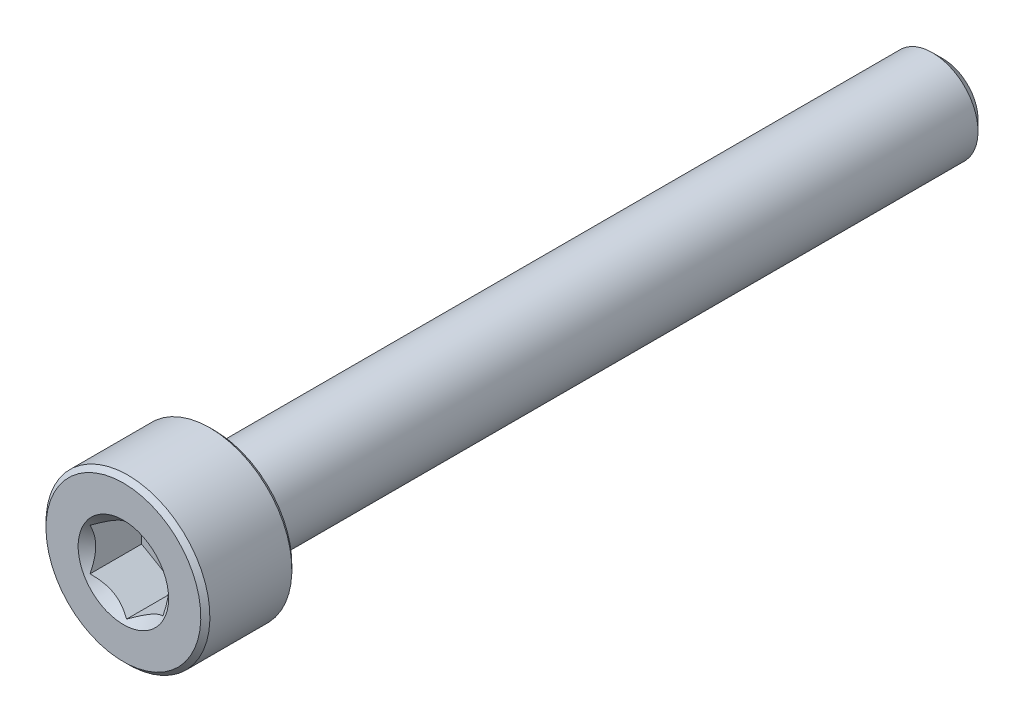
ISO-10303-21;
HEADER;
FILE_DESCRIPTION(('STEP AP214'),'2;1');
FILE_NAME('part.step','',(''),(''),'','','');
FILE_SCHEMA(('AUTOMOTIVE_DESIGN { 1 0 10303 214 1 1 1 1 }'));
ENDSEC;
DATA;
#1=APPLICATION_CONTEXT('core data for automotive mechanical design processes');
#2=APPLICATION_PROTOCOL_DEFINITION('international standard','automotive_design',2000,#1);
#3=PRODUCT_CONTEXT('',#1,'mechanical');
#4=PRODUCT('Part','Part','',(#3));
#5=PRODUCT_RELATED_PRODUCT_CATEGORY('part','',(#4));
#6=PRODUCT_DEFINITION_FORMATION('','',#4);
#7=PRODUCT_DEFINITION_CONTEXT('part definition',#1,'design');
#8=PRODUCT_DEFINITION('design','',#6,#7);
#9=PRODUCT_DEFINITION_SHAPE('','',#8);
#10=(LENGTH_UNIT() NAMED_UNIT(*) SI_UNIT(.MILLI.,.METRE.));
#11=(NAMED_UNIT(*) PLANE_ANGLE_UNIT() SI_UNIT($,.RADIAN.));
#12=(NAMED_UNIT(*) SI_UNIT($,.STERADIAN.) SOLID_ANGLE_UNIT());
#13=UNCERTAINTY_MEASURE_WITH_UNIT(LENGTH_MEASURE(1.E-05),#10,'distance_accuracy_value','');
#14=(GEOMETRIC_REPRESENTATION_CONTEXT(3) GLOBAL_UNCERTAINTY_ASSIGNED_CONTEXT((#13)) GLOBAL_UNIT_ASSIGNED_CONTEXT((#10,
#11,#12)) REPRESENTATION_CONTEXT('',''));
#15=CARTESIAN_POINT('',(0.,0.,0.));
#16=DIRECTION('',(0.,0.,1.));
#17=DIRECTION('',(1.,0.,0.));
#18=AXIS2_PLACEMENT_3D('',#15,#16,#17);
#19=CARTESIAN_POINT('',(0.,0.957716426222752,-11.25));
#20=DIRECTION('',(0.,0.,-1.));
#21=DIRECTION('',(0.,1.,0.));
#22=AXIS2_PLACEMENT_3D('',#19,#20,#21);
#23=PLANE('',#22);
#24=CARTESIAN_POINT('',(0.,0.,-11.25));
#25=DIRECTION('',(0.,0.,-1.));
#26=DIRECTION('',(0.,1.,0.));
#27=AXIS2_PLACEMENT_3D('',#24,#25,#26);
#28=CIRCLE('',#27,0.957716426222752);
#29=CARTESIAN_POINT('',(0.,0.957716426222752,-11.25));
#30=VERTEX_POINT('',#29);
#31=EDGE_CURVE('E50',#30,#30,#28,.T.);
#32=ORIENTED_EDGE('',*,*,#31,.T.);
#33=EDGE_LOOP('',(#32));
#34=FACE_BOUND('',#33,.T.);
#35=ADVANCED_FACE('F37',(#34),#23,.T.);
#36=CARTESIAN_POINT('',(0.,0.,-11.25));
#37=DIRECTION('',(0.,0.,1.));
#38=DIRECTION('',(0.,-1.,0.));
#39=AXIS2_PLACEMENT_3D('',#36,#37,#38);
#40=CONICAL_SURFACE('',#39,0.957716426222752,0.785398163397447);
#41=CARTESIAN_POINT('',(0.,0.,-10.9577164262228));
#42=DIRECTION('',(0.,0.,-1.));
#43=DIRECTION('',(0.,1.,0.));
#44=AXIS2_PLACEMENT_3D('',#41,#42,#43);
#45=CIRCLE('',#44,1.25);
#46=CARTESIAN_POINT('',(0.,1.25,-10.9577164262228));
#47=VERTEX_POINT('',#46);
#48=EDGE_CURVE('E153',#47,#47,#45,.T.);
#49=ORIENTED_EDGE('',*,*,#48,.T.);
#50=EDGE_LOOP('',(#49));
#51=FACE_BOUND('',#50,.T.);
#52=ORIENTED_EDGE('',*,*,#31,.F.);
#53=EDGE_LOOP('',(#52));
#54=FACE_BOUND('',#53,.T.);
#55=ADVANCED_FACE('F159',(#51,#54),#40,.T.);
#56=CARTESIAN_POINT('',(0.,0.,-11.25));
#57=DIRECTION('',(0.,0.,-1.));
#58=DIRECTION('',(0.,1.,0.));
#59=AXIS2_PLACEMENT_3D('',#56,#57,#58);
#60=CYLINDRICAL_SURFACE('',#59,1.25);
#61=CARTESIAN_POINT('',(0.,0.,8.625));
#62=DIRECTION('',(0.,0.,-1.));
#63=DIRECTION('',(0.,1.,0.));
#64=AXIS2_PLACEMENT_3D('',#61,#62,#63);
#65=CIRCLE('',#64,1.25);
#66=CARTESIAN_POINT('',(0.,1.25,8.625));
#67=VERTEX_POINT('',#66);
#68=EDGE_CURVE('E150',#67,#67,#65,.T.);
#69=ORIENTED_EDGE('',*,*,#68,.T.);
#70=EDGE_LOOP('',(#69));
#71=FACE_BOUND('',#70,.T.);
#72=ORIENTED_EDGE('',*,*,#48,.F.);
#73=EDGE_LOOP('',(#72));
#74=FACE_BOUND('',#73,.T.);
#75=ADVANCED_FACE('F161',(#71,#74),#60,.T.);
#76=CARTESIAN_POINT('',(0.,0.,8.625));
#77=DIRECTION('',(0.,0.,-1.));
#78=DIRECTION('',(0.,1.,0.));
#79=AXIS2_PLACEMENT_3D('',#76,#77,#78);
#80=TOROIDAL_SURFACE('',#79,1.375,0.125);
#81=CARTESIAN_POINT('',(0.,0.,8.75));
#82=DIRECTION('',(0.,0.,-1.));
#83=DIRECTION('',(0.,1.,0.));
#84=AXIS2_PLACEMENT_3D('',#81,#82,#83);
#85=CIRCLE('',#84,1.375);
#86=CARTESIAN_POINT('',(0.,1.375,8.75));
#87=VERTEX_POINT('',#86);
#88=EDGE_CURVE('E147',#87,#87,#85,.T.);
#89=ORIENTED_EDGE('',*,*,#88,.T.);
#90=EDGE_LOOP('',(#89));
#91=FACE_BOUND('',#90,.T.);
#92=ORIENTED_EDGE('',*,*,#68,.F.);
#93=EDGE_LOOP('',(#92));
#94=FACE_BOUND('',#93,.T.);
#95=ADVANCED_FACE('F167',(#91,#94),#80,.F.);
#96=CARTESIAN_POINT('',(0.,2.125,8.75));
#97=DIRECTION('',(0.,0.,-1.));
#98=DIRECTION('',(0.,1.,0.));
#99=AXIS2_PLACEMENT_3D('',#96,#97,#98);
#100=PLANE('',#99);
#101=CARTESIAN_POINT('',(0.,0.,8.75));
#102=DIRECTION('',(0.,0.,-1.));
#103=DIRECTION('',(0.,1.,0.));
#104=AXIS2_PLACEMENT_3D('',#101,#102,#103);
#105=CIRCLE('',#104,2.125);
#106=CARTESIAN_POINT('',(0.,2.125,8.75));
#107=VERTEX_POINT('',#106);
#108=EDGE_CURVE('E144',#107,#107,#105,.T.);
#109=ORIENTED_EDGE('',*,*,#108,.T.);
#110=EDGE_LOOP('',(#109));
#111=FACE_BOUND('',#110,.T.);
#112=ORIENTED_EDGE('',*,*,#88,.F.);
#113=EDGE_LOOP('',(#112));
#114=FACE_BOUND('',#113,.T.);
#115=ADVANCED_FACE('F173',(#111,#114),#100,.T.);
#116=CARTESIAN_POINT('',(0.,0.,8.75));
#117=DIRECTION('',(0.,0.,1.));
#118=DIRECTION('',(0.,-1.,0.));
#119=AXIS2_PLACEMENT_3D('',#116,#117,#118);
#120=CONICAL_SURFACE('',#119,2.125,0.78539816339745);
#121=CARTESIAN_POINT('',(0.,0.,8.875));
#122=DIRECTION('',(0.,0.,-1.));
#123=DIRECTION('',(0.,1.,0.));
#124=AXIS2_PLACEMENT_3D('',#121,#122,#123);
#125=CIRCLE('',#124,2.25);
#126=CARTESIAN_POINT('',(0.,2.25,8.875));
#127=VERTEX_POINT('',#126);
#128=EDGE_CURVE('E141',#127,#127,#125,.T.);
#129=ORIENTED_EDGE('',*,*,#128,.T.);
#130=EDGE_LOOP('',(#129));
#131=FACE_BOUND('',#130,.T.);
#132=ORIENTED_EDGE('',*,*,#108,.F.);
#133=EDGE_LOOP('',(#132));
#134=FACE_BOUND('',#133,.T.);
#135=ADVANCED_FACE('F177',(#131,#134),#120,.T.);
#136=CARTESIAN_POINT('',(0.,0.,-11.25));
#137=DIRECTION('',(0.,0.,-1.));
#138=DIRECTION('',(0.,1.,0.));
#139=AXIS2_PLACEMENT_3D('',#136,#137,#138);
#140=CYLINDRICAL_SURFACE('',#139,2.25);
#141=CARTESIAN_POINT('',(0.,0.,11.125));
#142=DIRECTION('',(0.,0.,-1.));
#143=DIRECTION('',(0.,1.,0.));
#144=AXIS2_PLACEMENT_3D('',#141,#142,#143);
#145=CIRCLE('',#144,2.25);
#146=CARTESIAN_POINT('',(0.,2.25,11.125));
#147=VERTEX_POINT('',#146);
#148=EDGE_CURVE('E138',#147,#147,#145,.T.);
#149=ORIENTED_EDGE('',*,*,#148,.T.);
#150=EDGE_LOOP('',(#149));
#151=FACE_BOUND('',#150,.T.);
#152=ORIENTED_EDGE('',*,*,#128,.F.);
#153=EDGE_LOOP('',(#152));
#154=FACE_BOUND('',#153,.T.);
#155=ADVANCED_FACE('F181',(#151,#154),#140,.T.);
#156=CARTESIAN_POINT('',(0.,0.,11.125));
#157=DIRECTION('',(0.,0.,-1.));
#158=DIRECTION('',(0.,1.,0.));
#159=AXIS2_PLACEMENT_3D('',#156,#157,#158);
#160=CONICAL_SURFACE('',#159,2.25,0.78539816339745);
#161=CARTESIAN_POINT('',(0.,0.,11.25));
#162=DIRECTION('',(0.,0.,-1.));
#163=DIRECTION('',(0.,1.,0.));
#164=AXIS2_PLACEMENT_3D('',#161,#162,#163);
#165=CIRCLE('',#164,2.125);
#166=CARTESIAN_POINT('',(0.,2.125,11.25));
#167=VERTEX_POINT('',#166);
#168=EDGE_CURVE('E135',#167,#167,#165,.T.);
#169=ORIENTED_EDGE('',*,*,#168,.T.);
#170=EDGE_LOOP('',(#169));
#171=FACE_BOUND('',#170,.T.);
#172=ORIENTED_EDGE('',*,*,#148,.F.);
#173=EDGE_LOOP('',(#172));
#174=FACE_BOUND('',#173,.T.);
#175=ADVANCED_FACE('F185',(#171,#174),#160,.T.);
#176=CARTESIAN_POINT('',(0.,0.,11.25));
#177=DIRECTION('',(0.,0.,1.));
#178=DIRECTION('',(0.,-1.,0.));
#179=AXIS2_PLACEMENT_3D('',#176,#177,#178);
#180=PLANE('',#179);
#181=CARTESIAN_POINT('',(0.,0.,11.25));
#182=DIRECTION('',(0.,0.,1.));
#183=DIRECTION('',(1.,0.,0.));
#184=AXIS2_PLACEMENT_3D('',#181,#182,#183);
#185=CIRCLE('',#184,1.2413030787577);
#186=CARTESIAN_POINT('',(1.2413030787577,0.,11.25));
#187=VERTEX_POINT('',#186);
#188=EDGE_CURVE('E109',#187,#187,#185,.T.);
#189=ORIENTED_EDGE('',*,*,#188,.F.);
#190=EDGE_LOOP('',(#189));
#191=FACE_BOUND('',#190,.T.);
#192=ORIENTED_EDGE('',*,*,#168,.F.);
#193=EDGE_LOOP('',(#192));
#194=FACE_BOUND('',#193,.T.);
#195=ADVANCED_FACE('F189',(#191,#194),#180,.T.);
#196=CARTESIAN_POINT('',(0.,0.,11.25));
#197=DIRECTION('',(0.,0.,1.));
#198=DIRECTION('',(1.,0.,0.));
#199=AXIS2_PLACEMENT_3D('',#196,#197,#198);
#200=CONICAL_SURFACE('',#199,1.2413030787577,0.78539816339745);
#201=ORIENTED_EDGE('',*,*,#188,.T.);
#202=EDGE_LOOP('',(#201));
#203=FACE_BOUND('',#202,.T.);
#204=CARTESIAN_POINT('',(-0.00019999999999932,-1.15481600843309,11.1635129469942));
#205=CARTESIAN_POINT('',(0.0341825950071818,-1.13496520795026,11.1436753904473));
#206=CARTESIAN_POINT('',(0.0691401181398261,-1.11478247255942,11.1250024802604));
#207=CARTESIAN_POINT('',(0.140422802956091,-1.07362739529219,11.0908122023447));
#208=CARTESIAN_POINT('',(0.176754750528985,-1.0526511355808,11.075313868645));
#209=CARTESIAN_POINT('',(0.250016613803312,-1.01035337909803,11.0487647667638));
#210=CARTESIAN_POINT('',(0.286927851445415,-0.989042666109241,11.0376472336185));
#211=CARTESIAN_POINT('',(0.36156272931086,-0.945952199282691,11.0205173253977));
#212=CARTESIAN_POINT('',(0.399284088108636,-0.924173762626596,11.0144921570882));
#213=CARTESIAN_POINT('',(0.464292198417934,-0.886641312640014,11.0090580145891));
#214=CARTESIAN_POINT('',(0.491494371528173,-0.870936130672275,11.0082543979383));
#215=CARTESIAN_POINT('',(0.545846040669112,-0.839556179862848,11.0096041590384));
#216=CARTESIAN_POINT('',(0.572995523754876,-0.823881418494923,11.0117581891688));
#217=CARTESIAN_POINT('',(0.654056277326961,-0.777080970599367,11.02251443175));
#218=CARTESIAN_POINT('',(0.707564140978428,-0.74618819111643,11.0354120160369));
#219=CARTESIAN_POINT('',(0.801476065143432,-0.691968116419649,11.0665381902237));
#220=CARTESIAN_POINT('',(0.842320523671834,-0.668386557293372,11.0831352573234));
#221=CARTESIAN_POINT('',(0.922409637381943,-0.622147085933682,11.1205223843068));
#222=CARTESIAN_POINT('',(0.961659010870437,-0.599486449584575,11.141298801439));
#223=CARTESIAN_POINT('',(1.0002,-0.577234799135788,11.1635129469942));
#224=B_SPLINE_CURVE_WITH_KNOTS('',3,(#204,#205,#206,#207,#208,#209,#210,#211,#212,#213,#214,
#215,#216,#217,#218,#219,#220,#221,#222,#223),.UNSPECIFIED.,.F.,.F.,(4,2,2,2,2,2,2,2,2,4),(0.,
0.13323767682856,0.26725222983449,0.3991370762693,0.530689603280768,0.624814864263846,
0.718960890149133,0.907306626112097,1.05710100361789,1.20641411519286),.UNSPECIFIED.);
#225=CARTESIAN_POINT('',(0.,-1.15470053837925,11.1633974596216));
#226=VERTEX_POINT('',#225);
#227=CARTESIAN_POINT('',(1.,-0.577350269189626,11.1633974596216));
#228=VERTEX_POINT('',#227);
#229=EDGE_CURVE('E12',#226,#228,#224,.T.);
#230=ORIENTED_EDGE('',*,*,#229,.F.);
#231=CARTESIAN_POINT('',(-1.0002,-0.577234799135788,11.1635129469942));
#232=CARTESIAN_POINT('',(-0.965817404992819,-0.597085599618622,11.1436753904473));
#233=CARTESIAN_POINT('',(-0.930859881860175,-0.617268335009457,11.1250024802604));
#234=CARTESIAN_POINT('',(-0.85957719704391,-0.658423412276686,11.0908122023447));
#235=CARTESIAN_POINT('',(-0.823245249471016,-0.67939967198808,11.075313868645));
#236=CARTESIAN_POINT('',(-0.749983386196689,-0.721697428470846,11.0487647667638));
#237=CARTESIAN_POINT('',(-0.713072148554586,-0.743008141459637,11.0376472336185));
#238=CARTESIAN_POINT('',(-0.638437270689141,-0.786098608286186,11.0205173253977));
#239=CARTESIAN_POINT('',(-0.600715911891365,-0.80787704494228,11.0144921570882));
#240=CARTESIAN_POINT('',(-0.535707801582067,-0.845409494928862,11.0090580145891));
#241=CARTESIAN_POINT('',(-0.508505628471829,-0.861114676896601,11.0082543979383));
#242=CARTESIAN_POINT('',(-0.454153959330889,-0.892494627706028,11.0096041590384));
#243=CARTESIAN_POINT('',(-0.427004476245125,-0.908169389073953,11.0117581891688));
#244=CARTESIAN_POINT('',(-0.345943722673041,-0.95496983696951,11.02251443175));
#245=CARTESIAN_POINT('',(-0.292435859021573,-0.985862616452446,11.0354120160369));
#246=CARTESIAN_POINT('',(-0.198523934856569,-1.04008269114923,11.0665381902237));
#247=CARTESIAN_POINT('',(-0.157679476328167,-1.0636642502755,11.0831352573234));
#248=CARTESIAN_POINT('',(-0.0775903626180569,-1.1099037216352,11.1205223843068));
#249=CARTESIAN_POINT('',(-0.0383409891295626,-1.1325643579843,11.141298801439));
#250=CARTESIAN_POINT('',(0.000200000000000279,-1.15481600843309,11.1635129469942));
#251=B_SPLINE_CURVE_WITH_KNOTS('',3,(#231,#232,#233,#234,#235,#236,#237,#238,#239,#240,#241,
#242,#243,#244,#245,#246,#247,#248,#249,#250),.UNSPECIFIED.,.F.,.F.,(4,2,2,2,2,2,2,2,2,4),(0.,
0.133237676828559,0.26725222983449,0.399137076269299,0.530689603280766,0.624814864263845,
0.718960890149131,0.907306626112095,1.05710100361789,1.20641411519286),.UNSPECIFIED.);
#252=CARTESIAN_POINT('',(-1.,-0.577350269189626,11.1633974596216));
#253=VERTEX_POINT('',#252);
#254=EDGE_CURVE('E95',#253,#226,#251,.T.);
#255=ORIENTED_EDGE('',*,*,#254,.F.);
#256=CARTESIAN_POINT('',(-1.,-1.21199087789934,11.5799772552729));
#257=CARTESIAN_POINT('',(-1.,-1.18273650300522,11.5574155469366));
#258=CARTESIAN_POINT('',(-1.,-1.15332592158341,11.5350570338119));
#259=CARTESIAN_POINT('',(-1.,-1.09412680336146,11.4908320719692));
#260=CARTESIAN_POINT('',(-1.,-1.06433818018075,11.4689657389968));
#261=CARTESIAN_POINT('',(-1.,-0.973871293541519,11.4039212875776));
#262=CARTESIAN_POINT('',(-1.,-0.912535008128867,11.3616436137258));
#263=CARTESIAN_POINT('',(-1.,-0.783508251342875,11.27806824785));
#264=CARTESIAN_POINT('',(-1.,-0.715662620346606,11.2370076103326));
#265=CARTESIAN_POINT('',(-1.,-0.576509894905891,11.1615014706694));
#266=CARTESIAN_POINT('',(-1.,-0.505215555513883,11.1270336262159));
#267=CARTESIAN_POINT('',(-1.,-0.398764046939012,11.0848487824632));
#268=CARTESIAN_POINT('',(-1.,-0.365313297980423,11.0728493894825));
#269=CARTESIAN_POINT('',(-1.,-0.297551245132093,11.0515303099529));
#270=CARTESIAN_POINT('',(-1.,-0.263239887100778,11.0422107924589));
#271=CARTESIAN_POINT('',(-1.,-0.194571067470057,11.026911675875));
#272=CARTESIAN_POINT('',(-1.,-0.160227555987669,11.0208704830847));
#273=CARTESIAN_POINT('',(-1.,-0.0910948269867777,11.0122522450376));
#274=CARTESIAN_POINT('',(-1.,-0.0563055613802768,11.009675576765));
#275=CARTESIAN_POINT('',(-1.,0.011792715265401,11.0082129551204));
#276=CARTESIAN_POINT('',(-1.,0.0450983170825067,11.0091670383534));
#277=CARTESIAN_POINT('',(-1.,0.111441413420383,11.014343622111));
#278=CARTESIAN_POINT('',(-1.,0.144478971732106,11.0185653204679));
#279=CARTESIAN_POINT('',(-1.,0.210624763290572,11.0301084789686));
#280=CARTESIAN_POINT('',(-1.,0.243723154740698,11.0374854347904));
#281=CARTESIAN_POINT('',(-1.,0.309187738497535,11.0549289992095));
#282=CARTESIAN_POINT('',(-1.,0.341553969590706,11.0649954649653));
#283=CARTESIAN_POINT('',(-1.,0.440875348086755,11.0997425706523));
#284=CARTESIAN_POINT('',(-1.,0.506480526276305,11.1282699754181));
#285=CARTESIAN_POINT('',(-1.,0.634628446237198,11.1917592247633));
#286=CARTESIAN_POINT('',(-1.,0.697159414671815,11.2267436843145));
#287=CARTESIAN_POINT('',(-1.,0.816694357126197,11.2989855582188));
#288=CARTESIAN_POINT('',(-1.,0.873818851530727,11.3360460703574));
#289=CARTESIAN_POINT('',(-1.,0.957979712513753,11.3933669564399));
#290=CARTESIAN_POINT('',(-1.,0.985671461150835,11.4126817594542));
#291=CARTESIAN_POINT('',(-1.,1.0406749612098,11.4518298926459));
#292=CARTESIAN_POINT('',(-1.,1.06798681474316,11.4716630791934));
#293=CARTESIAN_POINT('',(-1.,1.09514019811391,11.4917114368574));
#294=B_SPLINE_CURVE_WITH_KNOTS('',3,(#256,#257,#258,#259,#260,#261,#262,#263,#264,#265,#266,
#267,#268,#269,#270,#271,#272,#273,#274,#275,#276,#277,#278,#279,#280,#281,#282,#283,#284,#285,
#286,#287,#288,#289,#290,#291,#292,#293),.UNSPECIFIED.,.F.,.F.,(4,2,2,2,2,2,2,2,2,2,2,2,2,2,2,2,
2,2,4),(0.,0.110828944200309,0.221683685263867,0.445078388583645,0.682811068621037,
0.919723239940847,1.02624790401867,1.13277928653702,1.23723298361624,1.34169804566787,
1.44148938783186,1.54125623996228,1.64285505347063,1.74444847208079,1.95844200767913,
2.17319976124347,2.37737685814119,2.47865984803709,2.57991506662171),.UNSPECIFIED.);
#295=CARTESIAN_POINT('',(-1.,0.577350269189626,11.1633974596216));
#296=VERTEX_POINT('',#295);
#297=EDGE_CURVE('E108',#296,#253,#294,.F.);
#298=ORIENTED_EDGE('',*,*,#297,.F.);
#299=CARTESIAN_POINT('',(0.000199999999999444,1.15481600843309,11.1635129469942));
#300=CARTESIAN_POINT('',(-0.0341825950071816,1.13496520795026,11.1436753904473));
#301=CARTESIAN_POINT('',(-0.0691401181398259,1.11478247255942,11.1250024802604));
#302=CARTESIAN_POINT('',(-0.14042280295609,1.07362739529219,11.0908122023447));
#303=CARTESIAN_POINT('',(-0.176754750528985,1.0526511355808,11.075313868645));
#304=CARTESIAN_POINT('',(-0.250016613803311,1.01035337909803,11.0487647667638));
#305=CARTESIAN_POINT('',(-0.286927851445415,0.989042666109241,11.0376472336185));
#306=CARTESIAN_POINT('',(-0.36156272931086,0.945952199282691,11.0205173253977));
#307=CARTESIAN_POINT('',(-0.399284088108636,0.924173762626596,11.0144921570882));
#308=CARTESIAN_POINT('',(-0.464292198417934,0.886641312640014,11.0090580145891));
#309=CARTESIAN_POINT('',(-0.491494371528172,0.870936130672275,11.0082543979383));
#310=CARTESIAN_POINT('',(-0.545846040669112,0.839556179862848,11.0096041590384));
#311=CARTESIAN_POINT('',(-0.572995523754876,0.823881418494923,11.0117581891688));
#312=CARTESIAN_POINT('',(-0.65405627732696,0.777080970599366,11.02251443175));
#313=CARTESIAN_POINT('',(-0.707564140978428,0.74618819111643,11.0354120160369));
#314=CARTESIAN_POINT('',(-0.801476065143431,0.691968116419649,11.0665381902237));
#315=CARTESIAN_POINT('',(-0.842320523671834,0.668386557293372,11.0831352573234));
#316=CARTESIAN_POINT('',(-0.922409637381943,0.622147085933682,11.1205223843068));
#317=CARTESIAN_POINT('',(-0.961659010870437,0.599486449584575,11.141298801439));
#318=CARTESIAN_POINT('',(-1.0002,0.577234799135788,11.1635129469942));
#319=B_SPLINE_CURVE_WITH_KNOTS('',3,(#299,#300,#301,#302,#303,#304,#305,#306,#307,#308,#309,
#310,#311,#312,#313,#314,#315,#316,#317,#318),.UNSPECIFIED.,.F.,.F.,(4,2,2,2,2,2,2,2,2,4),(0.,
0.13323767682856,0.26725222983449,0.3991370762693,0.530689603280768,0.624814864263846,
0.718960890149133,0.907306626112097,1.05710100361789,1.20641411519286),.UNSPECIFIED.);
#320=CARTESIAN_POINT('',(0.,1.15470053837925,11.1633974596216));
#321=VERTEX_POINT('',#320);
#322=EDGE_CURVE('E239',#321,#296,#319,.T.);
#323=ORIENTED_EDGE('',*,*,#322,.F.);
#324=CARTESIAN_POINT('',(1.0002,0.577234799135788,11.1635129469942));
#325=CARTESIAN_POINT('',(0.965817404992819,0.597085599618622,11.1436753904473));
#326=CARTESIAN_POINT('',(0.930859881860175,0.617268335009457,11.1250024802604));
#327=CARTESIAN_POINT('',(0.85957719704391,0.658423412276686,11.0908122023447));
#328=CARTESIAN_POINT('',(0.823245249471016,0.67939967198808,11.075313868645));
#329=CARTESIAN_POINT('',(0.749983386196689,0.721697428470846,11.0487647667638));
#330=CARTESIAN_POINT('',(0.713072148554586,0.743008141459637,11.0376472336185));
#331=CARTESIAN_POINT('',(0.638437270689141,0.786098608286186,11.0205173253977));
#332=CARTESIAN_POINT('',(0.600715911891365,0.807877044942281,11.0144921570882));
#333=CARTESIAN_POINT('',(0.535707801582067,0.845409494928862,11.0090580145891));
#334=CARTESIAN_POINT('',(0.508505628471829,0.861114676896601,11.0082543979383));
#335=CARTESIAN_POINT('',(0.454153959330889,0.892494627706029,11.0096041590384));
#336=CARTESIAN_POINT('',(0.427004476245125,0.908169389073953,11.0117581891688));
#337=CARTESIAN_POINT('',(0.345943722673041,0.95496983696951,11.02251443175));
#338=CARTESIAN_POINT('',(0.292435859021573,0.985862616452447,11.0354120160369));
#339=CARTESIAN_POINT('',(0.198523934856569,1.04008269114923,11.0665381902237));
#340=CARTESIAN_POINT('',(0.157679476328166,1.06366425027551,11.0831352573234));
#341=CARTESIAN_POINT('',(0.0775903626180561,1.1099037216352,11.1205223843068));
#342=CARTESIAN_POINT('',(0.0383409891295622,1.1325643579843,11.141298801439));
#343=CARTESIAN_POINT('',(-0.000199999999999845,1.15481600843309,11.1635129469942));
#344=B_SPLINE_CURVE_WITH_KNOTS('',3,(#324,#325,#326,#327,#328,#329,#330,#331,#332,#333,#334,
#335,#336,#337,#338,#339,#340,#341,#342,#343),.UNSPECIFIED.,.F.,.F.,(4,2,2,2,2,2,2,2,2,4),(0.,
0.133237676828559,0.26725222983449,0.399137076269299,0.530689603280767,0.624814864263845,
0.718960890149131,0.907306626112096,1.05710100361789,1.20641411519286),.UNSPECIFIED.);
#345=CARTESIAN_POINT('',(1.,0.577350269189626,11.1633974596216));
#346=VERTEX_POINT('',#345);
#347=EDGE_CURVE('E212',#346,#321,#344,.T.);
#348=ORIENTED_EDGE('',*,*,#347,.F.);
#349=CARTESIAN_POINT('',(1.,-1.21199087789934,11.5799772552729));
#350=CARTESIAN_POINT('',(1.,-1.18273650300522,11.5574155469366));
#351=CARTESIAN_POINT('',(1.,-1.15332592158341,11.5350570338119));
#352=CARTESIAN_POINT('',(1.,-1.09412680336146,11.4908320719692));
#353=CARTESIAN_POINT('',(1.,-1.06433818018075,11.4689657389968));
#354=CARTESIAN_POINT('',(1.,-0.973871293541519,11.4039212875776));
#355=CARTESIAN_POINT('',(1.,-0.912535008128866,11.3616436137258));
#356=CARTESIAN_POINT('',(1.,-0.783508251342874,11.27806824785));
#357=CARTESIAN_POINT('',(1.,-0.715662620346606,11.2370076103326));
#358=CARTESIAN_POINT('',(1.,-0.576509894905891,11.1615014706694));
#359=CARTESIAN_POINT('',(1.,-0.505215555513882,11.1270336262159));
#360=CARTESIAN_POINT('',(1.,-0.398764046939011,11.0848487824632));
#361=CARTESIAN_POINT('',(1.,-0.365313297980422,11.0728493894825));
#362=CARTESIAN_POINT('',(1.,-0.297551245132092,11.0515303099529));
#363=CARTESIAN_POINT('',(1.,-0.263239887100776,11.0422107924589));
#364=CARTESIAN_POINT('',(1.,-0.194571067470055,11.026911675875));
#365=CARTESIAN_POINT('',(1.,-0.160227555987666,11.0208704830847));
#366=CARTESIAN_POINT('',(1.,-0.091094826986775,11.0122522450376));
#367=CARTESIAN_POINT('',(1.,-0.0563055613802738,11.009675576765));
#368=CARTESIAN_POINT('',(1.,0.0117927152654041,11.0082129551204));
#369=CARTESIAN_POINT('',(1.,0.0450983170825096,11.0091670383534));
#370=CARTESIAN_POINT('',(1.,0.111441413420386,11.014343622111));
#371=CARTESIAN_POINT('',(1.,0.144478971732109,11.0185653204679));
#372=CARTESIAN_POINT('',(1.,0.210624763290574,11.0301084789686));
#373=CARTESIAN_POINT('',(1.,0.2437231547407,11.0374854347904));
#374=CARTESIAN_POINT('',(1.,0.309187738497538,11.0549289992095));
#375=CARTESIAN_POINT('',(1.,0.341553969590708,11.0649954649653));
#376=CARTESIAN_POINT('',(1.,0.440875348086757,11.0997425706523));
#377=CARTESIAN_POINT('',(1.,0.506480526276307,11.1282699754181));
#378=CARTESIAN_POINT('',(1.,0.6346284462372,11.1917592247633));
#379=CARTESIAN_POINT('',(1.,0.697159414671818,11.2267436843145));
#380=CARTESIAN_POINT('',(1.,0.8166943571262,11.2989855582188));
#381=CARTESIAN_POINT('',(1.,0.87381885153073,11.3360460703574));
#382=CARTESIAN_POINT('',(1.,0.957979712513757,11.39336695644));
#383=CARTESIAN_POINT('',(1.,0.985671461150839,11.4126817594542));
#384=CARTESIAN_POINT('',(1.,1.04067496120981,11.4518298926459));
#385=CARTESIAN_POINT('',(1.,1.06798681474317,11.4716630791934));
#386=CARTESIAN_POINT('',(1.,1.09514019811391,11.4917114368574));
#387=B_SPLINE_CURVE_WITH_KNOTS('',3,(#349,#350,#351,#352,#353,#354,#355,#356,#357,#358,#359,
#360,#361,#362,#363,#364,#365,#366,#367,#368,#369,#370,#371,#372,#373,#374,#375,#376,#377,#378,
#379,#380,#381,#382,#383,#384,#385,#386),.UNSPECIFIED.,.F.,.F.,(4,2,2,2,2,2,2,2,2,2,2,2,2,2,2,2,
2,2,4),(0.,0.110828944200309,0.221683685263867,0.445078388583646,0.682811068621037,
0.919723239940847,1.02624790401867,1.13277928653702,1.23723298361625,1.34169804566788,
1.44148938783186,1.54125623996228,1.64285505347063,1.74444847208079,1.95844200767913,
2.17319976124347,2.3773768581412,2.47865984803709,2.57991506662172),.UNSPECIFIED.);
#388=EDGE_CURVE('E57',#228,#346,#387,.T.);
#389=ORIENTED_EDGE('',*,*,#388,.F.);
#390=EDGE_LOOP('',(#230,#255,#298,#323,#348,#389));
#391=FACE_BOUND('',#390,.T.);
#392=ADVANCED_FACE('F94',(#203,#391),#200,.F.);
#393=CARTESIAN_POINT('',(0.,2.125,9.75));
#394=DIRECTION('',(0.,0.,-1.));
#395=DIRECTION('',(0.,1.,0.));
#396=AXIS2_PLACEMENT_3D('',#393,#394,#395);
#397=PLANE('',#396);
#398=DIRECTION('',(0.866025403784439,0.5,0.));
#399=VECTOR('',#398,1.);
#400=CARTESIAN_POINT('',(0.,-1.15470053837925,9.75));
#401=LINE('',#400,#399);
#402=CARTESIAN_POINT('',(0.,-1.15470053837925,9.75));
#403=VERTEX_POINT('',#402);
#404=CARTESIAN_POINT('',(1.,-0.577350269189626,9.75));
#405=VERTEX_POINT('',#404);
#406=EDGE_CURVE('E112',#403,#405,#401,.T.);
#407=ORIENTED_EDGE('',*,*,#406,.T.);
#408=DIRECTION('',(0.,1.,0.));
#409=VECTOR('',#408,1.);
#410=CARTESIAN_POINT('',(1.,-0.577350269189626,9.75));
#411=LINE('',#410,#409);
#412=CARTESIAN_POINT('',(1.,0.577350269189626,9.75));
#413=VERTEX_POINT('',#412);
#414=EDGE_CURVE('E64',#405,#413,#411,.T.);
#415=ORIENTED_EDGE('',*,*,#414,.T.);
#416=DIRECTION('',(-0.866025403784439,0.5,0.));
#417=VECTOR('',#416,1.);
#418=CARTESIAN_POINT('',(1.,0.577350269189626,9.75));
#419=LINE('',#418,#417);
#420=CARTESIAN_POINT('',(0.,1.15470053837925,9.75));
#421=VERTEX_POINT('',#420);
#422=EDGE_CURVE('E120',#413,#421,#419,.T.);
#423=ORIENTED_EDGE('',*,*,#422,.T.);
#424=DIRECTION('',(-0.866025403784438,-0.5,0.));
#425=VECTOR('',#424,1.);
#426=CARTESIAN_POINT('',(0.,1.15470053837925,9.75));
#427=LINE('',#426,#425);
#428=CARTESIAN_POINT('',(-1.,0.577350269189626,9.75));
#429=VERTEX_POINT('',#428);
#430=EDGE_CURVE('E127',#421,#429,#427,.T.);
#431=ORIENTED_EDGE('',*,*,#430,.T.);
#432=DIRECTION('',(0.,-1.,0.));
#433=VECTOR('',#432,1.);
#434=CARTESIAN_POINT('',(-1.,0.577350269189626,9.75));
#435=LINE('',#434,#433);
#436=CARTESIAN_POINT('',(-1.,-0.577350269189626,9.75));
#437=VERTEX_POINT('',#436);
#438=EDGE_CURVE('E123',#429,#437,#435,.T.);
#439=ORIENTED_EDGE('',*,*,#438,.T.);
#440=DIRECTION('',(0.866025403784439,-0.5,0.));
#441=VECTOR('',#440,1.);
#442=CARTESIAN_POINT('',(-1.,-0.577350269189626,9.75));
#443=LINE('',#442,#441);
#444=EDGE_CURVE('E113',#437,#403,#443,.T.);
#445=ORIENTED_EDGE('',*,*,#444,.T.);
#446=EDGE_LOOP('',(#407,#415,#423,#431,#439,#445));
#447=FACE_BOUND('',#446,.T.);
#448=ADVANCED_FACE('F194',(#447),#397,.F.);
#449=CARTESIAN_POINT('',(0.,-1.15470053837925,5.69494953669611));
#450=DIRECTION('',(0.5,-0.866025403784438,0.));
#451=DIRECTION('',(0.866025403784439,0.5,0.));
#452=AXIS2_PLACEMENT_3D('',#449,#450,#451);
#453=PLANE('',#452);
#454=DIRECTION('',(0.,0.,1.));
#455=VECTOR('',#454,1.);
#456=CARTESIAN_POINT('',(0.,-1.15470053837925,5.69494953669611));
#457=LINE('',#456,#455);
#458=EDGE_CURVE('E104',#403,#226,#457,.T.);
#459=ORIENTED_EDGE('',*,*,#458,.T.);
#460=ORIENTED_EDGE('',*,*,#229,.T.);
#461=DIRECTION('',(0.,0.,1.));
#462=VECTOR('',#461,1.);
#463=CARTESIAN_POINT('',(1.,-0.577350269189626,5.69494953669611));
#464=LINE('',#463,#462);
#465=EDGE_CURVE('E115',#405,#228,#464,.T.);
#466=ORIENTED_EDGE('',*,*,#465,.F.);
#467=ORIENTED_EDGE('',*,*,#406,.F.);
#468=EDGE_LOOP('',(#459,#460,#466,#467));
#469=FACE_BOUND('',#468,.T.);
#470=ADVANCED_FACE('F111',(#469),#453,.F.);
#471=CARTESIAN_POINT('',(-1.,-0.577350269189626,5.69494953669611));
#472=DIRECTION('',(-0.5,-0.866025403784439,0.));
#473=DIRECTION('',(0.866025403784439,-0.5,0.));
#474=AXIS2_PLACEMENT_3D('',#471,#472,#473);
#475=PLANE('',#474);
#476=DIRECTION('',(0.,0.,1.));
#477=VECTOR('',#476,1.);
#478=CARTESIAN_POINT('',(-1.,-0.577350269189626,5.69494953669611));
#479=LINE('',#478,#477);
#480=EDGE_CURVE('E107',#437,#253,#479,.T.);
#481=ORIENTED_EDGE('',*,*,#480,.T.);
#482=ORIENTED_EDGE('',*,*,#254,.T.);
#483=ORIENTED_EDGE('',*,*,#458,.F.);
#484=ORIENTED_EDGE('',*,*,#444,.F.);
#485=EDGE_LOOP('',(#481,#482,#483,#484));
#486=FACE_BOUND('',#485,.T.);
#487=ADVANCED_FACE('F103',(#486),#475,.F.);
#488=CARTESIAN_POINT('',(-1.,0.577350269189626,5.69494953669611));
#489=DIRECTION('',(-1.,0.,0.));
#490=DIRECTION('',(0.,0.,1.));
#491=AXIS2_PLACEMENT_3D('',#488,#489,#490);
#492=PLANE('',#491);
#493=DIRECTION('',(0.,0.,1.));
#494=VECTOR('',#493,1.);
#495=CARTESIAN_POINT('',(-1.,0.577350269189626,5.69494953669611));
#496=LINE('',#495,#494);
#497=EDGE_CURVE('E124',#429,#296,#496,.T.);
#498=ORIENTED_EDGE('',*,*,#497,.T.);
#499=ORIENTED_EDGE('',*,*,#297,.T.);
#500=ORIENTED_EDGE('',*,*,#480,.F.);
#501=ORIENTED_EDGE('',*,*,#438,.F.);
#502=EDGE_LOOP('',(#498,#499,#500,#501));
#503=FACE_BOUND('',#502,.T.);
#504=ADVANCED_FACE('F248',(#503),#492,.F.);
#505=CARTESIAN_POINT('',(0.,1.15470053837925,5.69494953669611));
#506=DIRECTION('',(-0.5,0.866025403784438,0.));
#507=DIRECTION('',(-0.866025403784438,-0.5,0.));
#508=AXIS2_PLACEMENT_3D('',#505,#506,#507);
#509=PLANE('',#508);
#510=DIRECTION('',(0.,0.,1.));
#511=VECTOR('',#510,1.);
#512=CARTESIAN_POINT('',(0.,1.15470053837925,5.69494953669611));
#513=LINE('',#512,#511);
#514=EDGE_CURVE('E128',#421,#321,#513,.T.);
#515=ORIENTED_EDGE('',*,*,#514,.T.);
#516=ORIENTED_EDGE('',*,*,#322,.T.);
#517=ORIENTED_EDGE('',*,*,#497,.F.);
#518=ORIENTED_EDGE('',*,*,#430,.F.);
#519=EDGE_LOOP('',(#515,#516,#517,#518));
#520=FACE_BOUND('',#519,.T.);
#521=ADVANCED_FACE('F245',(#520),#509,.F.);
#522=CARTESIAN_POINT('',(1.,0.577350269189626,5.69494953669611));
#523=DIRECTION('',(0.5,0.866025403784439,0.));
#524=DIRECTION('',(-0.866025403784439,0.5,0.));
#525=AXIS2_PLACEMENT_3D('',#522,#523,#524);
#526=PLANE('',#525);
#527=DIRECTION('',(0.,0.,1.));
#528=VECTOR('',#527,1.);
#529=CARTESIAN_POINT('',(1.,0.577350269189626,5.69494953669611));
#530=LINE('',#529,#528);
#531=EDGE_CURVE('E131',#413,#346,#530,.T.);
#532=ORIENTED_EDGE('',*,*,#531,.T.);
#533=ORIENTED_EDGE('',*,*,#347,.T.);
#534=ORIENTED_EDGE('',*,*,#514,.F.);
#535=ORIENTED_EDGE('',*,*,#422,.F.);
#536=EDGE_LOOP('',(#532,#533,#534,#535));
#537=FACE_BOUND('',#536,.T.);
#538=ADVANCED_FACE('F202',(#537),#526,.F.);
#539=CARTESIAN_POINT('',(1.,-0.577350269189626,5.69494953669611));
#540=DIRECTION('',(1.,0.,0.));
#541=DIRECTION('',(0.,0.,-1.));
#542=AXIS2_PLACEMENT_3D('',#539,#540,#541);
#543=PLANE('',#542);
#544=ORIENTED_EDGE('',*,*,#465,.T.);
#545=ORIENTED_EDGE('',*,*,#388,.T.);
#546=ORIENTED_EDGE('',*,*,#531,.F.);
#547=ORIENTED_EDGE('',*,*,#414,.F.);
#548=EDGE_LOOP('',(#544,#545,#546,#547));
#549=FACE_BOUND('',#548,.T.);
#550=ADVANCED_FACE('F198',(#549),#543,.F.);
#551=CLOSED_SHELL('',(#35,#55,#75,#95,#115,#135,#155,#175,#195,#392,#448,#470,#487,#504,#521,
#538,#550));
#552=MANIFOLD_SOLID_BREP('B2',#551);
#553=ADVANCED_BREP_SHAPE_REPRESENTATION('',(#18,#552),#14);
#554=SHAPE_DEFINITION_REPRESENTATION(#9,#553);
ENDSEC;
END-ISO-10303-21;
